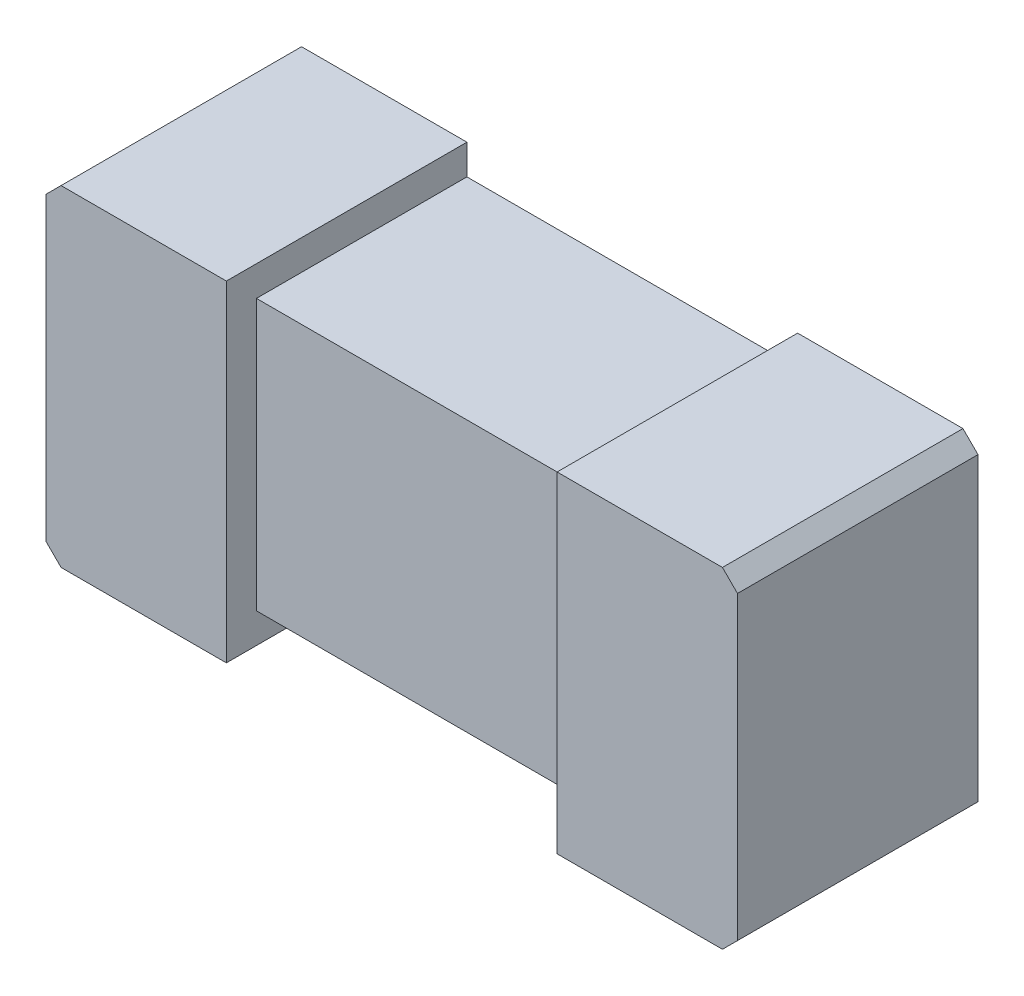
ISO-10303-21;
HEADER;
FILE_DESCRIPTION(('STEP AP214'),'2;1');
FILE_NAME('part.step','',(''),(''),'','','');
FILE_SCHEMA(('AUTOMOTIVE_DESIGN { 1 0 10303 214 1 1 1 1 }'));
ENDSEC;
DATA;
#1=APPLICATION_CONTEXT('core data for automotive mechanical design processes');
#2=APPLICATION_PROTOCOL_DEFINITION('international standard','automotive_design',2000,#1);
#3=PRODUCT_CONTEXT('',#1,'mechanical');
#4=PRODUCT('Part','Part','',(#3));
#5=PRODUCT_RELATED_PRODUCT_CATEGORY('part','',(#4));
#6=PRODUCT_DEFINITION_FORMATION('','',#4);
#7=PRODUCT_DEFINITION_CONTEXT('part definition',#1,'design');
#8=PRODUCT_DEFINITION('design','',#6,#7);
#9=PRODUCT_DEFINITION_SHAPE('','',#8);
#10=(LENGTH_UNIT() NAMED_UNIT(*) SI_UNIT(.MILLI.,.METRE.));
#11=(NAMED_UNIT(*) PLANE_ANGLE_UNIT() SI_UNIT($,.RADIAN.));
#12=(NAMED_UNIT(*) SI_UNIT($,.STERADIAN.) SOLID_ANGLE_UNIT());
#13=UNCERTAINTY_MEASURE_WITH_UNIT(LENGTH_MEASURE(1.E-05),#10,'distance_accuracy_value','');
#14=(GEOMETRIC_REPRESENTATION_CONTEXT(3) GLOBAL_UNCERTAINTY_ASSIGNED_CONTEXT((#13)) GLOBAL_UNIT_ASSIGNED_CONTEXT((#10,
#11,#12)) REPRESENTATION_CONTEXT('',''));
#15=CARTESIAN_POINT('',(0.,0.,0.));
#16=DIRECTION('',(0.,0.,1.));
#17=DIRECTION('',(1.,0.,0.));
#18=AXIS2_PLACEMENT_3D('',#15,#16,#17);
#19=CARTESIAN_POINT('',(0.,0.825,0.4));
#20=DIRECTION('',(0.,0.,1.));
#21=DIRECTION('',(1.,0.,0.));
#22=AXIS2_PLACEMENT_3D('',#19,#20,#21);
#23=PLANE('',#22);
#24=DIRECTION('',(-1.,0.,0.));
#25=VECTOR('',#24,1.);
#26=CARTESIAN_POINT('',(0.55,0.275,0.4));
#27=LINE('',#26,#25);
#28=CARTESIAN_POINT('',(0.55,0.275,0.4));
#29=VERTEX_POINT('',#28);
#30=CARTESIAN_POINT('',(0.275,0.275,0.4));
#31=VERTEX_POINT('',#30);
#32=EDGE_CURVE('E11',#29,#31,#27,.T.);
#33=ORIENTED_EDGE('',*,*,#32,.T.);
#34=DIRECTION('',(0.,1.,0.));
#35=VECTOR('',#34,1.);
#36=CARTESIAN_POINT('',(0.275,-0.275,0.4));
#37=LINE('',#36,#35);
#38=CARTESIAN_POINT('',(0.275,-0.275,0.4));
#39=VERTEX_POINT('',#38);
#40=EDGE_CURVE('E42',#39,#31,#37,.T.);
#41=ORIENTED_EDGE('',*,*,#40,.F.);
#42=DIRECTION('',(1.,0.,0.));
#43=VECTOR('',#42,1.);
#44=CARTESIAN_POINT('',(-0.55,-0.275,0.4));
#45=LINE('',#44,#43);
#46=CARTESIAN_POINT('',(0.55,-0.275,0.4));
#47=VERTEX_POINT('',#46);
#48=EDGE_CURVE('E21',#39,#47,#45,.T.);
#49=ORIENTED_EDGE('',*,*,#48,.T.);
#50=DIRECTION('',(0.707106781186547,0.707106781186548,0.));
#51=VECTOR('',#50,1.);
#52=CARTESIAN_POINT('',(0.55,-0.275,0.4));
#53=LINE('',#52,#51);
#54=CARTESIAN_POINT('',(0.575,-0.25,0.4));
#55=VERTEX_POINT('',#54);
#56=EDGE_CURVE('E276',#47,#55,#53,.T.);
#57=ORIENTED_EDGE('',*,*,#56,.T.);
#58=DIRECTION('',(0.,1.,0.));
#59=VECTOR('',#58,1.);
#60=CARTESIAN_POINT('',(0.575,-0.25,0.4));
#61=LINE('',#60,#59);
#62=CARTESIAN_POINT('',(0.575,0.25,0.4));
#63=VERTEX_POINT('',#62);
#64=EDGE_CURVE('E280',#55,#63,#61,.T.);
#65=ORIENTED_EDGE('',*,*,#64,.T.);
#66=DIRECTION('',(-0.707106781186547,0.707106781186548,0.));
#67=VECTOR('',#66,1.);
#68=CARTESIAN_POINT('',(0.575,0.25,0.4));
#69=LINE('',#68,#67);
#70=EDGE_CURVE('E200',#63,#29,#69,.T.);
#71=ORIENTED_EDGE('',*,*,#70,.T.);
#72=EDGE_LOOP('',(#33,#41,#49,#57,#65,#71));
#73=FACE_BOUND('',#72,.T.);
#74=ADVANCED_FACE('F17',(#73),#23,.T.);
#75=CARTESIAN_POINT('',(0.55,0.275,0.4));
#76=DIRECTION('',(0.,-1.,0.));
#77=DIRECTION('',(0.,0.,-1.));
#78=AXIS2_PLACEMENT_3D('',#75,#76,#77);
#79=PLANE('',#78);
#80=DIRECTION('',(-1.,0.,0.));
#81=VECTOR('',#80,1.);
#82=CARTESIAN_POINT('',(0.55,0.275,0.4));
#83=LINE('',#82,#81);
#84=CARTESIAN_POINT('',(-0.275,0.275,0.4));
#85=VERTEX_POINT('',#84);
#86=CARTESIAN_POINT('',(-0.55,0.275,0.4));
#87=VERTEX_POINT('',#86);
#88=EDGE_CURVE('E232',#85,#87,#83,.T.);
#89=ORIENTED_EDGE('',*,*,#88,.F.);
#90=DIRECTION('',(0.,0.,1.));
#91=VECTOR('',#90,1.);
#92=CARTESIAN_POINT('',(-0.275,0.275,0.));
#93=LINE('',#92,#91);
#94=CARTESIAN_POINT('',(-0.275,0.275,0.));
#95=VERTEX_POINT('',#94);
#96=EDGE_CURVE('E167',#95,#85,#93,.T.);
#97=ORIENTED_EDGE('',*,*,#96,.F.);
#98=DIRECTION('',(-1.,0.,0.));
#99=VECTOR('',#98,1.);
#100=CARTESIAN_POINT('',(0.55,0.275,0.));
#101=LINE('',#100,#99);
#102=CARTESIAN_POINT('',(-0.55,0.275,0.));
#103=VERTEX_POINT('',#102);
#104=EDGE_CURVE('E322',#95,#103,#101,.T.);
#105=ORIENTED_EDGE('',*,*,#104,.T.);
#106=DIRECTION('',(0.,0.,-1.));
#107=VECTOR('',#106,1.);
#108=CARTESIAN_POINT('',(-0.55,0.275,0.4));
#109=LINE('',#108,#107);
#110=EDGE_CURVE('E178',#87,#103,#109,.T.);
#111=ORIENTED_EDGE('',*,*,#110,.F.);
#112=EDGE_LOOP('',(#89,#97,#105,#111));
#113=FACE_BOUND('',#112,.T.);
#114=ADVANCED_FACE('F478',(#113),#79,.F.);
#115=CARTESIAN_POINT('',(-0.55,-0.275,0.4));
#116=DIRECTION('',(0.,1.,0.));
#117=DIRECTION('',(1.,0.,0.));
#118=AXIS2_PLACEMENT_3D('',#115,#116,#117);
#119=PLANE('',#118);
#120=ORIENTED_EDGE('',*,*,#48,.F.);
#121=DIRECTION('',(0.,0.,1.));
#122=VECTOR('',#121,1.);
#123=CARTESIAN_POINT('',(0.275,-0.275,0.));
#124=LINE('',#123,#122);
#125=CARTESIAN_POINT('',(0.275,-0.275,0.));
#126=VERTEX_POINT('',#125);
#127=EDGE_CURVE('E267',#126,#39,#124,.T.);
#128=ORIENTED_EDGE('',*,*,#127,.F.);
#129=DIRECTION('',(1.,0.,0.));
#130=VECTOR('',#129,1.);
#131=CARTESIAN_POINT('',(-0.55,-0.275,0.));
#132=LINE('',#131,#130);
#133=CARTESIAN_POINT('',(0.55,-0.275,0.));
#134=VERTEX_POINT('',#133);
#135=EDGE_CURVE('E215',#126,#134,#132,.T.);
#136=ORIENTED_EDGE('',*,*,#135,.T.);
#137=DIRECTION('',(0.,0.,-1.));
#138=VECTOR('',#137,1.);
#139=CARTESIAN_POINT('',(0.55,-0.275,0.4));
#140=LINE('',#139,#138);
#141=EDGE_CURVE('E223',#47,#134,#140,.T.);
#142=ORIENTED_EDGE('',*,*,#141,.F.);
#143=EDGE_LOOP('',(#120,#128,#136,#142));
#144=FACE_BOUND('',#143,.T.);
#145=ADVANCED_FACE('F19',(#144),#119,.F.);
#146=CARTESIAN_POINT('',(0.575,0.25,0.4));
#147=DIRECTION('',(-0.707106781186548,-0.707106781186547,0.));
#148=DIRECTION('',(-0.707106781186547,0.707106781186548,0.));
#149=AXIS2_PLACEMENT_3D('',#146,#147,#148);
#150=PLANE('',#149);
#151=DIRECTION('',(-0.707106781186547,0.707106781186548,0.));
#152=VECTOR('',#151,1.);
#153=CARTESIAN_POINT('',(0.575,0.25,0.));
#154=LINE('',#153,#152);
#155=CARTESIAN_POINT('',(0.575,0.25,0.));
#156=VERTEX_POINT('',#155);
#157=CARTESIAN_POINT('',(0.55,0.275,0.));
#158=VERTEX_POINT('',#157);
#159=EDGE_CURVE('E198',#156,#158,#154,.T.);
#160=ORIENTED_EDGE('',*,*,#159,.T.);
#161=DIRECTION('',(0.,0.,-1.));
#162=VECTOR('',#161,1.);
#163=CARTESIAN_POINT('',(0.55,0.275,0.4));
#164=LINE('',#163,#162);
#165=EDGE_CURVE('E360',#29,#158,#164,.T.);
#166=ORIENTED_EDGE('',*,*,#165,.F.);
#167=ORIENTED_EDGE('',*,*,#70,.F.);
#168=DIRECTION('',(0.,0.,-1.));
#169=VECTOR('',#168,1.);
#170=CARTESIAN_POINT('',(0.575,0.25,0.4));
#171=LINE('',#170,#169);
#172=EDGE_CURVE('E194',#63,#156,#171,.T.);
#173=ORIENTED_EDGE('',*,*,#172,.T.);
#174=EDGE_LOOP('',(#160,#166,#167,#173));
#175=FACE_BOUND('',#174,.T.);
#176=ADVANCED_FACE('F196',(#175),#150,.F.);
#177=CARTESIAN_POINT('',(0.55,0.275,0.4));
#178=DIRECTION('',(0.,-1.,0.));
#179=DIRECTION('',(0.,0.,-1.));
#180=AXIS2_PLACEMENT_3D('',#177,#178,#179);
#181=PLANE('',#180);
#182=DIRECTION('',(-1.,0.,0.));
#183=VECTOR('',#182,1.);
#184=CARTESIAN_POINT('',(0.55,0.275,0.));
#185=LINE('',#184,#183);
#186=CARTESIAN_POINT('',(0.275,0.275,0.));
#187=VERTEX_POINT('',#186);
#188=EDGE_CURVE('E205',#158,#187,#185,.T.);
#189=ORIENTED_EDGE('',*,*,#188,.T.);
#190=DIRECTION('',(0.,0.,1.));
#191=VECTOR('',#190,1.);
#192=CARTESIAN_POINT('',(0.275,0.275,0.));
#193=LINE('',#192,#191);
#194=EDGE_CURVE('E266',#187,#31,#193,.T.);
#195=ORIENTED_EDGE('',*,*,#194,.T.);
#196=ORIENTED_EDGE('',*,*,#32,.F.);
#197=ORIENTED_EDGE('',*,*,#165,.T.);
#198=EDGE_LOOP('',(#189,#195,#196,#197));
#199=FACE_BOUND('',#198,.T.);
#200=ADVANCED_FACE('F510',(#199),#181,.F.);
#201=CARTESIAN_POINT('',(-0.55,0.275,0.4));
#202=DIRECTION('',(0.707106781186548,-0.707106781186547,0.));
#203=DIRECTION('',(0.,0.,-1.));
#204=AXIS2_PLACEMENT_3D('',#201,#202,#203);
#205=PLANE('',#204);
#206=DIRECTION('',(-0.707106781186547,-0.707106781186548,0.));
#207=VECTOR('',#206,1.);
#208=CARTESIAN_POINT('',(-0.55,0.275,0.));
#209=LINE('',#208,#207);
#210=CARTESIAN_POINT('',(-0.575,0.25,0.));
#211=VERTEX_POINT('',#210);
#212=EDGE_CURVE('E255',#103,#211,#209,.T.);
#213=ORIENTED_EDGE('',*,*,#212,.T.);
#214=DIRECTION('',(0.,0.,-1.));
#215=VECTOR('',#214,1.);
#216=CARTESIAN_POINT('',(-0.575,0.25,0.4));
#217=LINE('',#216,#215);
#218=CARTESIAN_POINT('',(-0.575,0.25,0.4));
#219=VERTEX_POINT('',#218);
#220=EDGE_CURVE('E236',#219,#211,#217,.T.);
#221=ORIENTED_EDGE('',*,*,#220,.F.);
#222=DIRECTION('',(-0.707106781186547,-0.707106781186548,0.));
#223=VECTOR('',#222,1.);
#224=CARTESIAN_POINT('',(-0.55,0.275,0.4));
#225=LINE('',#224,#223);
#226=EDGE_CURVE('E142',#87,#219,#225,.T.);
#227=ORIENTED_EDGE('',*,*,#226,.F.);
#228=ORIENTED_EDGE('',*,*,#110,.T.);
#229=EDGE_LOOP('',(#213,#221,#227,#228));
#230=FACE_BOUND('',#229,.T.);
#231=ADVANCED_FACE('F523',(#230),#205,.F.);
#232=CARTESIAN_POINT('',(-0.575,0.25,0.4));
#233=DIRECTION('',(1.,0.,0.));
#234=DIRECTION('',(0.,1.,0.));
#235=AXIS2_PLACEMENT_3D('',#232,#233,#234);
#236=PLANE('',#235);
#237=DIRECTION('',(0.,-1.,0.));
#238=VECTOR('',#237,1.);
#239=CARTESIAN_POINT('',(-0.575,0.25,0.));
#240=LINE('',#239,#238);
#241=CARTESIAN_POINT('',(-0.575,-0.25,0.));
#242=VERTEX_POINT('',#241);
#243=EDGE_CURVE('E256',#211,#242,#240,.T.);
#244=ORIENTED_EDGE('',*,*,#243,.T.);
#245=DIRECTION('',(0.,0.,-1.));
#246=VECTOR('',#245,1.);
#247=CARTESIAN_POINT('',(-0.575,-0.25,0.4));
#248=LINE('',#247,#246);
#249=CARTESIAN_POINT('',(-0.575,-0.25,0.4));
#250=VERTEX_POINT('',#249);
#251=EDGE_CURVE('E156',#250,#242,#248,.T.);
#252=ORIENTED_EDGE('',*,*,#251,.F.);
#253=DIRECTION('',(0.,-1.,0.));
#254=VECTOR('',#253,1.);
#255=CARTESIAN_POINT('',(-0.575,0.25,0.4));
#256=LINE('',#255,#254);
#257=EDGE_CURVE('E250',#219,#250,#256,.T.);
#258=ORIENTED_EDGE('',*,*,#257,.F.);
#259=ORIENTED_EDGE('',*,*,#220,.T.);
#260=EDGE_LOOP('',(#244,#252,#258,#259));
#261=FACE_BOUND('',#260,.T.);
#262=ADVANCED_FACE('F517',(#261),#236,.F.);
#263=CARTESIAN_POINT('',(-0.575,-0.25,0.4));
#264=DIRECTION('',(0.707106781186548,0.707106781186547,0.));
#265=DIRECTION('',(0.,0.,-1.));
#266=AXIS2_PLACEMENT_3D('',#263,#264,#265);
#267=PLANE('',#266);
#268=DIRECTION('',(0.707106781186547,-0.707106781186548,0.));
#269=VECTOR('',#268,1.);
#270=CARTESIAN_POINT('',(-0.575,-0.25,0.));
#271=LINE('',#270,#269);
#272=CARTESIAN_POINT('',(-0.55,-0.275,0.));
#273=VERTEX_POINT('',#272);
#274=EDGE_CURVE('E274',#242,#273,#271,.T.);
#275=ORIENTED_EDGE('',*,*,#274,.T.);
#276=DIRECTION('',(0.,0.,-1.));
#277=VECTOR('',#276,1.);
#278=CARTESIAN_POINT('',(-0.55,-0.275,0.4));
#279=LINE('',#278,#277);
#280=CARTESIAN_POINT('',(-0.55,-0.275,0.4));
#281=VERTEX_POINT('',#280);
#282=EDGE_CURVE('E114',#281,#273,#279,.T.);
#283=ORIENTED_EDGE('',*,*,#282,.F.);
#284=DIRECTION('',(0.707106781186547,-0.707106781186548,0.));
#285=VECTOR('',#284,1.);
#286=CARTESIAN_POINT('',(-0.575,-0.25,0.4));
#287=LINE('',#286,#285);
#288=EDGE_CURVE('E125',#250,#281,#287,.T.);
#289=ORIENTED_EDGE('',*,*,#288,.F.);
#290=ORIENTED_EDGE('',*,*,#251,.T.);
#291=EDGE_LOOP('',(#275,#283,#289,#290));
#292=FACE_BOUND('',#291,.T.);
#293=ADVANCED_FACE('F522',(#292),#267,.F.);
#294=CARTESIAN_POINT('',(-0.55,-0.275,0.4));
#295=DIRECTION('',(0.,1.,0.));
#296=DIRECTION('',(1.,0.,0.));
#297=AXIS2_PLACEMENT_3D('',#294,#295,#296);
#298=PLANE('',#297);
#299=DIRECTION('',(1.,0.,0.));
#300=VECTOR('',#299,1.);
#301=CARTESIAN_POINT('',(-0.55,-0.275,0.));
#302=LINE('',#301,#300);
#303=CARTESIAN_POINT('',(-0.275,-0.275,0.));
#304=VERTEX_POINT('',#303);
#305=EDGE_CURVE('E275',#273,#304,#302,.T.);
#306=ORIENTED_EDGE('',*,*,#305,.T.);
#307=DIRECTION('',(0.,0.,1.));
#308=VECTOR('',#307,1.);
#309=CARTESIAN_POINT('',(-0.275,-0.275,0.));
#310=LINE('',#309,#308);
#311=CARTESIAN_POINT('',(-0.275,-0.275,0.4));
#312=VERTEX_POINT('',#311);
#313=EDGE_CURVE('E302',#304,#312,#310,.T.);
#314=ORIENTED_EDGE('',*,*,#313,.T.);
#315=DIRECTION('',(1.,0.,0.));
#316=VECTOR('',#315,1.);
#317=CARTESIAN_POINT('',(-0.55,-0.275,0.4));
#318=LINE('',#317,#316);
#319=EDGE_CURVE('E288',#281,#312,#318,.T.);
#320=ORIENTED_EDGE('',*,*,#319,.F.);
#321=ORIENTED_EDGE('',*,*,#282,.T.);
#322=EDGE_LOOP('',(#306,#314,#320,#321));
#323=FACE_BOUND('',#322,.T.);
#324=ADVANCED_FACE('F373',(#323),#298,.F.);
#325=CARTESIAN_POINT('',(0.55,-0.275,0.4));
#326=DIRECTION('',(-0.707106781186548,0.707106781186547,0.));
#327=DIRECTION('',(0.,0.,1.));
#328=AXIS2_PLACEMENT_3D('',#325,#326,#327);
#329=PLANE('',#328);
#330=DIRECTION('',(0.707106781186547,0.707106781186548,0.));
#331=VECTOR('',#330,1.);
#332=CARTESIAN_POINT('',(0.55,-0.275,0.));
#333=LINE('',#332,#331);
#334=CARTESIAN_POINT('',(0.575,-0.25,0.));
#335=VERTEX_POINT('',#334);
#336=EDGE_CURVE('E230',#134,#335,#333,.T.);
#337=ORIENTED_EDGE('',*,*,#336,.T.);
#338=DIRECTION('',(0.,0.,-1.));
#339=VECTOR('',#338,1.);
#340=CARTESIAN_POINT('',(0.575,-0.25,0.4));
#341=LINE('',#340,#339);
#342=EDGE_CURVE('E220',#55,#335,#341,.T.);
#343=ORIENTED_EDGE('',*,*,#342,.F.);
#344=ORIENTED_EDGE('',*,*,#56,.F.);
#345=ORIENTED_EDGE('',*,*,#141,.T.);
#346=EDGE_LOOP('',(#337,#343,#344,#345));
#347=FACE_BOUND('',#346,.T.);
#348=ADVANCED_FACE('F705',(#347),#329,.F.);
#349=CARTESIAN_POINT('',(0.575,-0.25,0.4));
#350=DIRECTION('',(-1.,0.,0.));
#351=DIRECTION('',(0.,0.,1.));
#352=AXIS2_PLACEMENT_3D('',#349,#350,#351);
#353=PLANE('',#352);
#354=DIRECTION('',(0.,1.,0.));
#355=VECTOR('',#354,1.);
#356=CARTESIAN_POINT('',(0.575,-0.25,0.));
#357=LINE('',#356,#355);
#358=EDGE_CURVE('E211',#335,#156,#357,.T.);
#359=ORIENTED_EDGE('',*,*,#358,.T.);
#360=ORIENTED_EDGE('',*,*,#172,.F.);
#361=ORIENTED_EDGE('',*,*,#64,.F.);
#362=ORIENTED_EDGE('',*,*,#342,.T.);
#363=EDGE_LOOP('',(#359,#360,#361,#362));
#364=FACE_BOUND('',#363,.T.);
#365=ADVANCED_FACE('F218',(#364),#353,.F.);
#366=CARTESIAN_POINT('',(0.,0.825,0.4));
#367=DIRECTION('',(0.,0.,1.));
#368=DIRECTION('',(1.,0.,0.));
#369=AXIS2_PLACEMENT_3D('',#366,#367,#368);
#370=PLANE('',#369);
#371=DIRECTION('',(0.,-1.,0.));
#372=VECTOR('',#371,1.);
#373=CARTESIAN_POINT('',(-0.275,-0.225,0.4));
#374=LINE('',#373,#372);
#375=EDGE_CURVE('E271',#85,#312,#374,.T.);
#376=ORIENTED_EDGE('',*,*,#375,.F.);
#377=ORIENTED_EDGE('',*,*,#88,.T.);
#378=ORIENTED_EDGE('',*,*,#226,.T.);
#379=ORIENTED_EDGE('',*,*,#257,.T.);
#380=ORIENTED_EDGE('',*,*,#288,.T.);
#381=ORIENTED_EDGE('',*,*,#319,.T.);
#382=EDGE_LOOP('',(#376,#377,#378,#379,#380,#381));
#383=FACE_BOUND('',#382,.T.);
#384=ADVANCED_FACE('F372',(#383),#370,.T.);
#385=CARTESIAN_POINT('',(0.,0.825,0.));
#386=DIRECTION('',(0.,0.,1.));
#387=DIRECTION('',(1.,0.,0.));
#388=AXIS2_PLACEMENT_3D('',#385,#386,#387);
#389=PLANE('',#388);
#390=ORIENTED_EDGE('',*,*,#104,.F.);
#391=DIRECTION('',(0.,-1.,0.));
#392=VECTOR('',#391,1.);
#393=CARTESIAN_POINT('',(-0.275,0.275,0.));
#394=LINE('',#393,#392);
#395=CARTESIAN_POINT('',(-0.275,0.225,0.));
#396=VERTEX_POINT('',#395);
#397=EDGE_CURVE('E246',#95,#396,#394,.T.);
#398=ORIENTED_EDGE('',*,*,#397,.T.);
#399=DIRECTION('',(1.,0.,0.));
#400=VECTOR('',#399,1.);
#401=CARTESIAN_POINT('',(0.275,0.225,0.));
#402=LINE('',#401,#400);
#403=CARTESIAN_POINT('',(0.275,0.225,0.));
#404=VERTEX_POINT('',#403);
#405=EDGE_CURVE('E242',#396,#404,#402,.T.);
#406=ORIENTED_EDGE('',*,*,#405,.T.);
#407=DIRECTION('',(0.,1.,0.));
#408=VECTOR('',#407,1.);
#409=CARTESIAN_POINT('',(0.275,0.225,0.));
#410=LINE('',#409,#408);
#411=EDGE_CURVE('E247',#404,#187,#410,.T.);
#412=ORIENTED_EDGE('',*,*,#411,.T.);
#413=ORIENTED_EDGE('',*,*,#188,.F.);
#414=ORIENTED_EDGE('',*,*,#159,.F.);
#415=ORIENTED_EDGE('',*,*,#358,.F.);
#416=ORIENTED_EDGE('',*,*,#336,.F.);
#417=ORIENTED_EDGE('',*,*,#135,.F.);
#418=DIRECTION('',(0.,1.,0.));
#419=VECTOR('',#418,1.);
#420=CARTESIAN_POINT('',(0.275,-0.275,0.));
#421=LINE('',#420,#419);
#422=CARTESIAN_POINT('',(0.275,-0.225,0.));
#423=VERTEX_POINT('',#422);
#424=EDGE_CURVE('E253',#126,#423,#421,.T.);
#425=ORIENTED_EDGE('',*,*,#424,.T.);
#426=DIRECTION('',(-1.,0.,0.));
#427=VECTOR('',#426,1.);
#428=CARTESIAN_POINT('',(-0.275,-0.225,0.));
#429=LINE('',#428,#427);
#430=CARTESIAN_POINT('',(-0.275,-0.225,0.));
#431=VERTEX_POINT('',#430);
#432=EDGE_CURVE('E281',#423,#431,#429,.T.);
#433=ORIENTED_EDGE('',*,*,#432,.T.);
#434=DIRECTION('',(0.,-1.,0.));
#435=VECTOR('',#434,1.);
#436=CARTESIAN_POINT('',(-0.275,-0.225,0.));
#437=LINE('',#436,#435);
#438=EDGE_CURVE('E285',#431,#304,#437,.T.);
#439=ORIENTED_EDGE('',*,*,#438,.T.);
#440=ORIENTED_EDGE('',*,*,#305,.F.);
#441=ORIENTED_EDGE('',*,*,#274,.F.);
#442=ORIENTED_EDGE('',*,*,#243,.F.);
#443=ORIENTED_EDGE('',*,*,#212,.F.);
#444=EDGE_LOOP('',(#390,#398,#406,#412,#413,#414,#415,#416,#417,#425,#433,#439,#440,#441,#442,#443));
#445=FACE_BOUND('',#444,.T.);
#446=ADVANCED_FACE('F209',(#445),#389,.F.);
#447=CARTESIAN_POINT('',(-0.275,-0.225,0.));
#448=DIRECTION('',(0.,1.,0.));
#449=DIRECTION('',(1.,0.,0.));
#450=AXIS2_PLACEMENT_3D('',#447,#448,#449);
#451=PLANE('',#450);
#452=DIRECTION('',(0.,0.,1.));
#453=VECTOR('',#452,1.);
#454=CARTESIAN_POINT('',(0.275,-0.225,0.));
#455=LINE('',#454,#453);
#456=CARTESIAN_POINT('',(0.275,-0.225,0.35));
#457=VERTEX_POINT('',#456);
#458=EDGE_CURVE('E240',#423,#457,#455,.T.);
#459=ORIENTED_EDGE('',*,*,#458,.T.);
#460=DIRECTION('',(1.,0.,0.));
#461=VECTOR('',#460,1.);
#462=CARTESIAN_POINT('',(0.275,-0.225,0.35));
#463=LINE('',#462,#461);
#464=CARTESIAN_POINT('',(-0.275,-0.225,0.35));
#465=VERTEX_POINT('',#464);
#466=EDGE_CURVE('E334',#465,#457,#463,.T.);
#467=ORIENTED_EDGE('',*,*,#466,.F.);
#468=DIRECTION('',(0.,0.,1.));
#469=VECTOR('',#468,1.);
#470=CARTESIAN_POINT('',(-0.275,-0.225,0.));
#471=LINE('',#470,#469);
#472=EDGE_CURVE('E327',#431,#465,#471,.T.);
#473=ORIENTED_EDGE('',*,*,#472,.F.);
#474=ORIENTED_EDGE('',*,*,#432,.F.);
#475=EDGE_LOOP('',(#459,#467,#473,#474));
#476=FACE_BOUND('',#475,.T.);
#477=ADVANCED_FACE('F416',(#476),#451,.F.);
#478=CARTESIAN_POINT('',(0.275,-0.275,0.));
#479=DIRECTION('',(1.,0.,0.));
#480=DIRECTION('',(0.,1.,0.));
#481=AXIS2_PLACEMENT_3D('',#478,#479,#480);
#482=PLANE('',#481);
#483=ORIENTED_EDGE('',*,*,#40,.T.);
#484=ORIENTED_EDGE('',*,*,#194,.F.);
#485=ORIENTED_EDGE('',*,*,#411,.F.);
#486=DIRECTION('',(0.,0.,1.));
#487=VECTOR('',#486,1.);
#488=CARTESIAN_POINT('',(0.275,0.225,0.));
#489=LINE('',#488,#487);
#490=CARTESIAN_POINT('',(0.275,0.225,0.35));
#491=VERTEX_POINT('',#490);
#492=EDGE_CURVE('E241',#404,#491,#489,.T.);
#493=ORIENTED_EDGE('',*,*,#492,.T.);
#494=DIRECTION('',(0.,-1.,0.));
#495=VECTOR('',#494,1.);
#496=CARTESIAN_POINT('',(0.275,4.775,0.35));
#497=LINE('',#496,#495);
#498=EDGE_CURVE('E270',#491,#457,#497,.T.);
#499=ORIENTED_EDGE('',*,*,#498,.T.);
#500=ORIENTED_EDGE('',*,*,#458,.F.);
#501=ORIENTED_EDGE('',*,*,#424,.F.);
#502=ORIENTED_EDGE('',*,*,#127,.T.);
#503=EDGE_LOOP('',(#483,#484,#485,#493,#499,#500,#501,#502));
#504=FACE_BOUND('',#503,.T.);
#505=ADVANCED_FACE('F421',(#504),#482,.F.);
#506=CARTESIAN_POINT('',(-0.275,-0.225,0.));
#507=DIRECTION('',(-1.,0.,0.));
#508=DIRECTION('',(0.,0.,1.));
#509=AXIS2_PLACEMENT_3D('',#506,#507,#508);
#510=PLANE('',#509);
#511=ORIENTED_EDGE('',*,*,#375,.T.);
#512=ORIENTED_EDGE('',*,*,#313,.F.);
#513=ORIENTED_EDGE('',*,*,#438,.F.);
#514=ORIENTED_EDGE('',*,*,#472,.T.);
#515=DIRECTION('',(0.,-1.,0.));
#516=VECTOR('',#515,1.);
#517=CARTESIAN_POINT('',(-0.275,4.775,0.35));
#518=LINE('',#517,#516);
#519=CARTESIAN_POINT('',(-0.275,0.225,0.35));
#520=VERTEX_POINT('',#519);
#521=EDGE_CURVE('E263',#520,#465,#518,.T.);
#522=ORIENTED_EDGE('',*,*,#521,.F.);
#523=DIRECTION('',(0.,0.,1.));
#524=VECTOR('',#523,1.);
#525=CARTESIAN_POINT('',(-0.275,0.225,0.));
#526=LINE('',#525,#524);
#527=EDGE_CURVE('E262',#396,#520,#526,.T.);
#528=ORIENTED_EDGE('',*,*,#527,.F.);
#529=ORIENTED_EDGE('',*,*,#397,.F.);
#530=ORIENTED_EDGE('',*,*,#96,.T.);
#531=EDGE_LOOP('',(#511,#512,#513,#514,#522,#528,#529,#530));
#532=FACE_BOUND('',#531,.T.);
#533=ADVANCED_FACE('F369',(#532),#510,.F.);
#534=CARTESIAN_POINT('',(0.275,0.225,0.));
#535=DIRECTION('',(0.,-1.,0.));
#536=DIRECTION('',(0.,0.,-1.));
#537=AXIS2_PLACEMENT_3D('',#534,#535,#536);
#538=PLANE('',#537);
#539=ORIENTED_EDGE('',*,*,#527,.T.);
#540=DIRECTION('',(1.,0.,0.));
#541=VECTOR('',#540,1.);
#542=CARTESIAN_POINT('',(0.275,0.225,0.35));
#543=LINE('',#542,#541);
#544=EDGE_CURVE('E258',#520,#491,#543,.T.);
#545=ORIENTED_EDGE('',*,*,#544,.T.);
#546=ORIENTED_EDGE('',*,*,#492,.F.);
#547=ORIENTED_EDGE('',*,*,#405,.F.);
#548=EDGE_LOOP('',(#539,#545,#546,#547));
#549=FACE_BOUND('',#548,.T.);
#550=ADVANCED_FACE('F434',(#549),#538,.F.);
#551=CARTESIAN_POINT('',(0.275,4.775,0.35));
#552=DIRECTION('',(0.,0.,-1.));
#553=DIRECTION('',(0.,-1.,0.));
#554=AXIS2_PLACEMENT_3D('',#551,#552,#553);
#555=PLANE('',#554);
#556=ORIENTED_EDGE('',*,*,#521,.T.);
#557=ORIENTED_EDGE('',*,*,#466,.T.);
#558=ORIENTED_EDGE('',*,*,#498,.F.);
#559=ORIENTED_EDGE('',*,*,#544,.F.);
#560=EDGE_LOOP('',(#556,#557,#558,#559));
#561=FACE_BOUND('',#560,.T.);
#562=ADVANCED_FACE('F439',(#561),#555,.F.);
#563=CLOSED_SHELL('',(#74,#114,#145,#176,#200,#231,#262,#293,#324,#348,#365,#384,#446,#477,#505,
#533,#550,#562));
#564=MANIFOLD_SOLID_BREP('B1',#563);
#565=ADVANCED_BREP_SHAPE_REPRESENTATION('',(#18,#564),#14);
#566=SHAPE_DEFINITION_REPRESENTATION(#9,#565);
ENDSEC;
END-ISO-10303-21;
